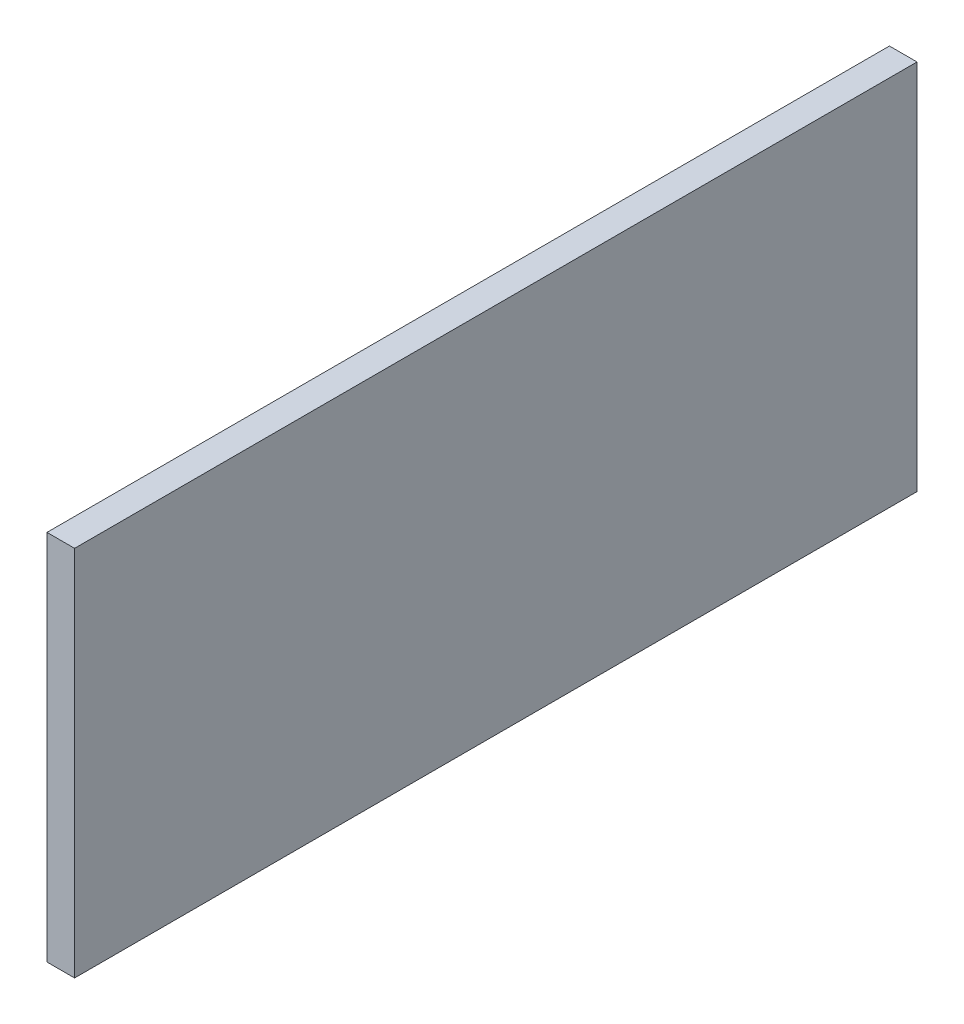
ISO-10303-21;
HEADER;
FILE_DESCRIPTION(('STEP AP214'),'2;1');
FILE_NAME('part.step','',(''),(''),'','','');
FILE_SCHEMA(('AUTOMOTIVE_DESIGN { 1 0 10303 214 1 1 1 1 }'));
ENDSEC;
DATA;
#1=APPLICATION_CONTEXT('core data for automotive mechanical design processes');
#2=APPLICATION_PROTOCOL_DEFINITION('international standard','automotive_design',2000,#1);
#3=PRODUCT_CONTEXT('',#1,'mechanical');
#4=PRODUCT('Part','Part','',(#3));
#5=PRODUCT_RELATED_PRODUCT_CATEGORY('part','',(#4));
#6=PRODUCT_DEFINITION_FORMATION('','',#4);
#7=PRODUCT_DEFINITION_CONTEXT('part definition',#1,'design');
#8=PRODUCT_DEFINITION('design','',#6,#7);
#9=PRODUCT_DEFINITION_SHAPE('','',#8);
#10=(LENGTH_UNIT() NAMED_UNIT(*) SI_UNIT(.MILLI.,.METRE.));
#11=(NAMED_UNIT(*) PLANE_ANGLE_UNIT() SI_UNIT($,.RADIAN.));
#12=(NAMED_UNIT(*) SI_UNIT($,.STERADIAN.) SOLID_ANGLE_UNIT());
#13=UNCERTAINTY_MEASURE_WITH_UNIT(LENGTH_MEASURE(1.E-05),#10,'distance_accuracy_value','');
#14=(GEOMETRIC_REPRESENTATION_CONTEXT(3) GLOBAL_UNCERTAINTY_ASSIGNED_CONTEXT((#13)) GLOBAL_UNIT_ASSIGNED_CONTEXT((#10,
#11,#12)) REPRESENTATION_CONTEXT('',''));
#15=CARTESIAN_POINT('',(0.,0.,0.));
#16=DIRECTION('',(0.,0.,1.));
#17=DIRECTION('',(1.,0.,0.));
#18=AXIS2_PLACEMENT_3D('',#15,#16,#17);
#19=CARTESIAN_POINT('',(-167.414847161572,-20.1861353711791,465.25));
#20=DIRECTION('',(1.,0.,0.));
#21=DIRECTION('',(0.,0.,-1.));
#22=AXIS2_PLACEMENT_3D('',#19,#20,#21);
#23=PLANE('',#22);
#24=DIRECTION('',(0.,-1.,0.));
#25=VECTOR('',#24,1.);
#26=CARTESIAN_POINT('',(-167.414847161572,-20.1861353711791,0.));
#27=LINE('',#26,#25);
#28=CARTESIAN_POINT('',(-167.414847161572,185.313864628821,0.));
#29=VERTEX_POINT('',#28);
#30=CARTESIAN_POINT('',(-167.414847161572,-20.1861353711791,0.));
#31=VERTEX_POINT('',#30);
#32=EDGE_CURVE('E95',#29,#31,#27,.T.);
#33=ORIENTED_EDGE('',*,*,#32,.T.);
#34=DIRECTION('',(0.,0.,-1.));
#35=VECTOR('',#34,1.);
#36=CARTESIAN_POINT('',(-167.414847161572,-20.1861353711791,465.25));
#37=LINE('',#36,#35);
#38=CARTESIAN_POINT('',(-167.414847161572,-20.1861353711791,465.25));
#39=VERTEX_POINT('',#38);
#40=EDGE_CURVE('E11',#39,#31,#37,.T.);
#41=ORIENTED_EDGE('',*,*,#40,.F.);
#42=DIRECTION('',(0.,-1.,0.));
#43=VECTOR('',#42,1.);
#44=CARTESIAN_POINT('',(-167.414847161572,-20.1861353711791,465.25));
#45=LINE('',#44,#43);
#46=CARTESIAN_POINT('',(-167.414847161572,185.313864628821,465.25));
#47=VERTEX_POINT('',#46);
#48=EDGE_CURVE('E83',#47,#39,#45,.T.);
#49=ORIENTED_EDGE('',*,*,#48,.F.);
#50=DIRECTION('',(0.,0.,-1.));
#51=VECTOR('',#50,1.);
#52=CARTESIAN_POINT('',(-167.414847161572,185.313864628821,465.25));
#53=LINE('',#52,#51);
#54=EDGE_CURVE('E91',#47,#29,#53,.T.);
#55=ORIENTED_EDGE('',*,*,#54,.T.);
#56=EDGE_LOOP('',(#33,#41,#49,#55));
#57=FACE_BOUND('',#56,.T.);
#58=ADVANCED_FACE('F32',(#57),#23,.F.);
#59=CARTESIAN_POINT('',(-167.414847161572,-20.1861353711791,465.25));
#60=DIRECTION('',(0.,1.,0.));
#61=DIRECTION('',(0.,0.,1.));
#62=AXIS2_PLACEMENT_3D('',#59,#60,#61);
#63=PLANE('',#62);
#64=DIRECTION('',(1.,0.,0.));
#65=VECTOR('',#64,1.);
#66=CARTESIAN_POINT('',(-167.414847161572,-20.1861353711791,0.));
#67=LINE('',#66,#65);
#68=CARTESIAN_POINT('',(-152.164847161572,-20.1861353711791,0.));
#69=VERTEX_POINT('',#68);
#70=EDGE_CURVE('E87',#31,#69,#67,.T.);
#71=ORIENTED_EDGE('',*,*,#70,.T.);
#72=DIRECTION('',(0.,0.,-1.));
#73=VECTOR('',#72,1.);
#74=CARTESIAN_POINT('',(-152.164847161572,-20.1861353711791,465.25));
#75=LINE('',#74,#73);
#76=CARTESIAN_POINT('',(-152.164847161572,-20.1861353711791,465.25));
#77=VERTEX_POINT('',#76);
#78=EDGE_CURVE('E40',#77,#69,#75,.T.);
#79=ORIENTED_EDGE('',*,*,#78,.F.);
#80=DIRECTION('',(1.,0.,0.));
#81=VECTOR('',#80,1.);
#82=CARTESIAN_POINT('',(-167.414847161572,-20.1861353711791,465.25));
#83=LINE('',#82,#81);
#84=EDGE_CURVE('E78',#39,#77,#83,.T.);
#85=ORIENTED_EDGE('',*,*,#84,.F.);
#86=ORIENTED_EDGE('',*,*,#40,.T.);
#87=EDGE_LOOP('',(#71,#79,#85,#86));
#88=FACE_BOUND('',#87,.T.);
#89=ADVANCED_FACE('F86',(#88),#63,.F.);
#90=CARTESIAN_POINT('',(-152.164847161572,-20.1861353711791,465.25));
#91=DIRECTION('',(-1.,0.,0.));
#92=DIRECTION('',(0.,0.,1.));
#93=AXIS2_PLACEMENT_3D('',#90,#91,#92);
#94=PLANE('',#93);
#95=DIRECTION('',(0.,1.,0.));
#96=VECTOR('',#95,1.);
#97=CARTESIAN_POINT('',(-152.164847161572,-20.1861353711791,0.));
#98=LINE('',#97,#96);
#99=CARTESIAN_POINT('',(-152.164847161572,185.313864628821,0.));
#100=VERTEX_POINT('',#99);
#101=EDGE_CURVE('E65',#69,#100,#98,.T.);
#102=ORIENTED_EDGE('',*,*,#101,.T.);
#103=DIRECTION('',(0.,0.,-1.));
#104=VECTOR('',#103,1.);
#105=CARTESIAN_POINT('',(-152.164847161572,185.313864628821,465.25));
#106=LINE('',#105,#104);
#107=CARTESIAN_POINT('',(-152.164847161572,185.313864628821,465.25));
#108=VERTEX_POINT('',#107);
#109=EDGE_CURVE('E88',#108,#100,#106,.T.);
#110=ORIENTED_EDGE('',*,*,#109,.F.);
#111=DIRECTION('',(0.,1.,0.));
#112=VECTOR('',#111,1.);
#113=CARTESIAN_POINT('',(-152.164847161572,-20.1861353711791,465.25));
#114=LINE('',#113,#112);
#115=EDGE_CURVE('E81',#77,#108,#114,.T.);
#116=ORIENTED_EDGE('',*,*,#115,.F.);
#117=ORIENTED_EDGE('',*,*,#78,.T.);
#118=EDGE_LOOP('',(#102,#110,#116,#117));
#119=FACE_BOUND('',#118,.T.);
#120=ADVANCED_FACE('F89',(#119),#94,.F.);
#121=CARTESIAN_POINT('',(-167.414847161572,185.313864628821,465.25));
#122=DIRECTION('',(0.,-1.,0.));
#123=DIRECTION('',(0.,0.,-1.));
#124=AXIS2_PLACEMENT_3D('',#121,#122,#123);
#125=PLANE('',#124);
#126=DIRECTION('',(-1.,0.,0.));
#127=VECTOR('',#126,1.);
#128=CARTESIAN_POINT('',(-167.414847161572,185.313864628821,0.));
#129=LINE('',#128,#127);
#130=EDGE_CURVE('E71',#100,#29,#129,.T.);
#131=ORIENTED_EDGE('',*,*,#130,.T.);
#132=ORIENTED_EDGE('',*,*,#54,.F.);
#133=DIRECTION('',(-1.,0.,0.));
#134=VECTOR('',#133,1.);
#135=CARTESIAN_POINT('',(-167.414847161572,185.313864628821,465.25));
#136=LINE('',#135,#134);
#137=EDGE_CURVE('E48',#108,#47,#136,.T.);
#138=ORIENTED_EDGE('',*,*,#137,.F.);
#139=ORIENTED_EDGE('',*,*,#109,.T.);
#140=EDGE_LOOP('',(#131,#132,#138,#139));
#141=FACE_BOUND('',#140,.T.);
#142=ADVANCED_FACE('F102',(#141),#125,.F.);
#143=CARTESIAN_POINT('',(0.,0.,465.25));
#144=DIRECTION('',(0.,0.,-1.));
#145=DIRECTION('',(-1.,0.,0.));
#146=AXIS2_PLACEMENT_3D('',#143,#144,#145);
#147=PLANE('',#146);
#148=ORIENTED_EDGE('',*,*,#48,.T.);
#149=ORIENTED_EDGE('',*,*,#84,.T.);
#150=ORIENTED_EDGE('',*,*,#115,.T.);
#151=ORIENTED_EDGE('',*,*,#137,.T.);
#152=EDGE_LOOP('',(#148,#149,#150,#151));
#153=FACE_BOUND('',#152,.T.);
#154=ADVANCED_FACE('F79',(#153),#147,.F.);
#155=CARTESIAN_POINT('',(0.,0.,0.));
#156=DIRECTION('',(0.,0.,-1.));
#157=DIRECTION('',(-1.,0.,0.));
#158=AXIS2_PLACEMENT_3D('',#155,#156,#157);
#159=PLANE('',#158);
#160=ORIENTED_EDGE('',*,*,#32,.F.);
#161=ORIENTED_EDGE('',*,*,#130,.F.);
#162=ORIENTED_EDGE('',*,*,#101,.F.);
#163=ORIENTED_EDGE('',*,*,#70,.F.);
#164=EDGE_LOOP('',(#160,#161,#162,#163));
#165=FACE_BOUND('',#164,.T.);
#166=ADVANCED_FACE('F105',(#165),#159,.T.);
#167=CLOSED_SHELL('',(#58,#89,#120,#142,#154,#166));
#168=MANIFOLD_SOLID_BREP('B2',#167);
#169=ADVANCED_BREP_SHAPE_REPRESENTATION('',(#18,#168),#14);
#170=SHAPE_DEFINITION_REPRESENTATION(#9,#169);
ENDSEC;
END-ISO-10303-21;
